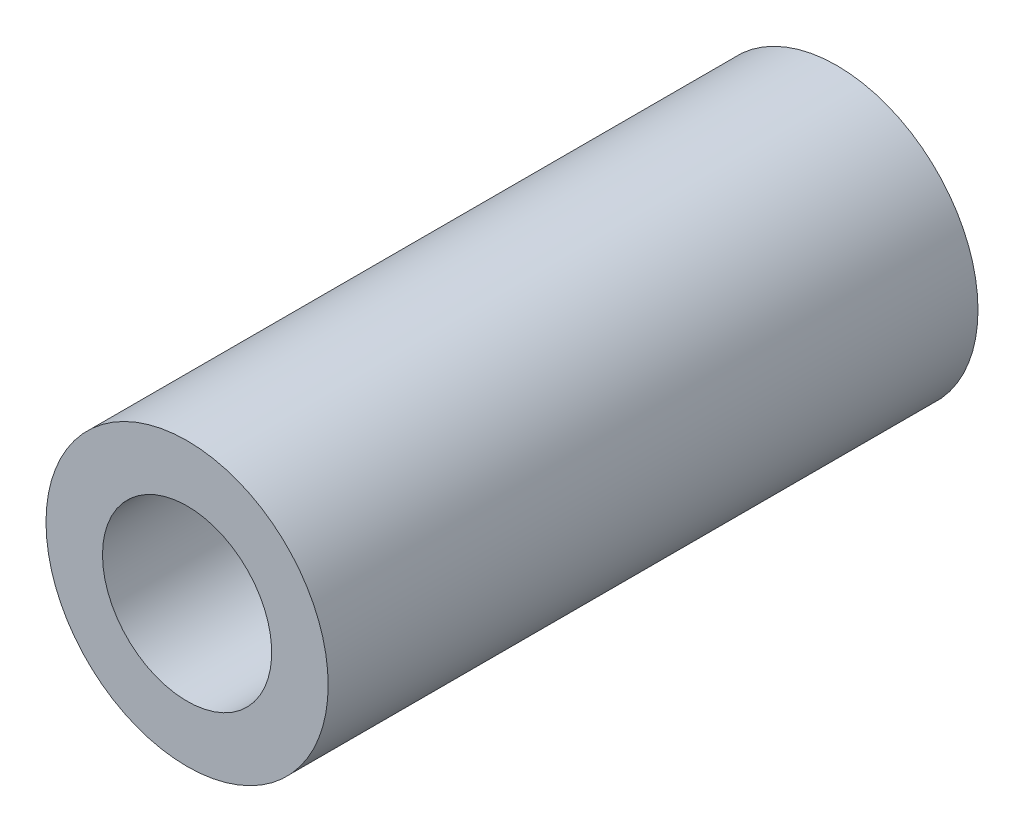
ISO-10303-21;
HEADER;
FILE_DESCRIPTION(('STEP AP214'),'2;1');
FILE_NAME('part.step','',(''),(''),'','','');
FILE_SCHEMA(('AUTOMOTIVE_DESIGN { 1 0 10303 214 1 1 1 1 }'));
ENDSEC;
DATA;
#1=APPLICATION_CONTEXT('core data for automotive mechanical design processes');
#2=APPLICATION_PROTOCOL_DEFINITION('international standard','automotive_design',2000,#1);
#3=PRODUCT_CONTEXT('',#1,'mechanical');
#4=PRODUCT('Part','Part','',(#3));
#5=PRODUCT_RELATED_PRODUCT_CATEGORY('part','',(#4));
#6=PRODUCT_DEFINITION_FORMATION('','',#4);
#7=PRODUCT_DEFINITION_CONTEXT('part definition',#1,'design');
#8=PRODUCT_DEFINITION('design','',#6,#7);
#9=PRODUCT_DEFINITION_SHAPE('','',#8);
#10=(LENGTH_UNIT() NAMED_UNIT(*) SI_UNIT(.MILLI.,.METRE.));
#11=(NAMED_UNIT(*) PLANE_ANGLE_UNIT() SI_UNIT($,.RADIAN.));
#12=(NAMED_UNIT(*) SI_UNIT($,.STERADIAN.) SOLID_ANGLE_UNIT());
#13=UNCERTAINTY_MEASURE_WITH_UNIT(LENGTH_MEASURE(1.E-05),#10,'distance_accuracy_value','');
#14=(GEOMETRIC_REPRESENTATION_CONTEXT(3) GLOBAL_UNCERTAINTY_ASSIGNED_CONTEXT((#13)) GLOBAL_UNIT_ASSIGNED_CONTEXT((#10,
#11,#12)) REPRESENTATION_CONTEXT('',''));
#15=CARTESIAN_POINT('',(0.,0.,0.));
#16=DIRECTION('',(0.,0.,1.));
#17=DIRECTION('',(1.,0.,0.));
#18=AXIS2_PLACEMENT_3D('',#15,#16,#17);
#19=CARTESIAN_POINT('',(0.,0.,146.05));
#20=DIRECTION('',(0.,0.,-1.));
#21=DIRECTION('',(-1.,0.,0.));
#22=AXIS2_PLACEMENT_3D('',#19,#20,#21);
#23=CYLINDRICAL_SURFACE('',#22,31.710080134117);
#24=CARTESIAN_POINT('',(0.,0.,146.05));
#25=DIRECTION('',(0.,0.,1.));
#26=DIRECTION('',(1.,0.,0.));
#27=AXIS2_PLACEMENT_3D('',#24,#25,#26);
#28=CIRCLE('',#27,31.710080134117);
#29=CARTESIAN_POINT('',(31.710080134117,0.,146.05));
#30=VERTEX_POINT('',#29);
#31=EDGE_CURVE('E10',#30,#30,#28,.T.);
#32=ORIENTED_EDGE('',*,*,#31,.F.);
#33=EDGE_LOOP('',(#32));
#34=FACE_BOUND('',#33,.T.);
#35=CARTESIAN_POINT('',(0.,0.,0.));
#36=DIRECTION('',(0.,0.,1.));
#37=DIRECTION('',(1.,0.,0.));
#38=AXIS2_PLACEMENT_3D('',#35,#36,#37);
#39=CIRCLE('',#38,31.710080134117);
#40=CARTESIAN_POINT('',(31.710080134117,0.,0.));
#41=VERTEX_POINT('',#40);
#42=EDGE_CURVE('E36',#41,#41,#39,.T.);
#43=ORIENTED_EDGE('',*,*,#42,.T.);
#44=EDGE_LOOP('',(#43));
#45=FACE_BOUND('',#44,.T.);
#46=ADVANCED_FACE('F33',(#34,#45),#23,.T.);
#47=CARTESIAN_POINT('',(0.,0.,146.05));
#48=DIRECTION('',(0.,0.,1.));
#49=DIRECTION('',(1.,0.,0.));
#50=AXIS2_PLACEMENT_3D('',#47,#48,#49);
#51=PLANE('',#50);
#52=CARTESIAN_POINT('',(0.,0.,146.05));
#53=DIRECTION('',(0.,0.,-1.));
#54=DIRECTION('',(-1.,0.,0.));
#55=AXIS2_PLACEMENT_3D('',#52,#53,#54);
#56=CIRCLE('',#55,19.0140130256067);
#57=CARTESIAN_POINT('',(-19.0140130256067,0.,146.05));
#58=VERTEX_POINT('',#57);
#59=EDGE_CURVE('E43',#58,#58,#56,.T.);
#60=ORIENTED_EDGE('',*,*,#59,.T.);
#61=EDGE_LOOP('',(#60));
#62=FACE_BOUND('',#61,.T.);
#63=ORIENTED_EDGE('',*,*,#31,.T.);
#64=EDGE_LOOP('',(#63));
#65=FACE_BOUND('',#64,.T.);
#66=ADVANCED_FACE('F51',(#62,#65),#51,.T.);
#67=CARTESIAN_POINT('',(0.,0.,0.));
#68=DIRECTION('',(0.,0.,1.));
#69=DIRECTION('',(1.,0.,0.));
#70=AXIS2_PLACEMENT_3D('',#67,#68,#69);
#71=PLANE('',#70);
#72=CARTESIAN_POINT('',(0.,0.,0.));
#73=DIRECTION('',(0.,0.,-1.));
#74=DIRECTION('',(-1.,0.,0.));
#75=AXIS2_PLACEMENT_3D('',#72,#73,#74);
#76=CIRCLE('',#75,19.0140130256067);
#77=CARTESIAN_POINT('',(-19.0140130256067,0.,0.));
#78=VERTEX_POINT('',#77);
#79=EDGE_CURVE('E45',#78,#78,#76,.T.);
#80=ORIENTED_EDGE('',*,*,#79,.F.);
#81=EDGE_LOOP('',(#80));
#82=FACE_BOUND('',#81,.T.);
#83=ORIENTED_EDGE('',*,*,#42,.F.);
#84=EDGE_LOOP('',(#83));
#85=FACE_BOUND('',#84,.T.);
#86=ADVANCED_FACE('F56',(#82,#85),#71,.F.);
#87=CARTESIAN_POINT('',(0.,0.,146.05));
#88=DIRECTION('',(0.,0.,-1.));
#89=DIRECTION('',(-1.,0.,0.));
#90=AXIS2_PLACEMENT_3D('',#87,#88,#89);
#91=CYLINDRICAL_SURFACE('',#90,19.0140130256067);
#92=ORIENTED_EDGE('',*,*,#59,.F.);
#93=EDGE_LOOP('',(#92));
#94=FACE_BOUND('',#93,.T.);
#95=ORIENTED_EDGE('',*,*,#79,.T.);
#96=EDGE_LOOP('',(#95));
#97=FACE_BOUND('',#96,.T.);
#98=ADVANCED_FACE('F53',(#94,#97),#91,.F.);
#99=CLOSED_SHELL('',(#46,#66,#86,#98));
#100=MANIFOLD_SOLID_BREP('B2',#99);
#101=ADVANCED_BREP_SHAPE_REPRESENTATION('',(#18,#100),#14);
#102=SHAPE_DEFINITION_REPRESENTATION(#9,#101);
ENDSEC;
END-ISO-10303-21;
